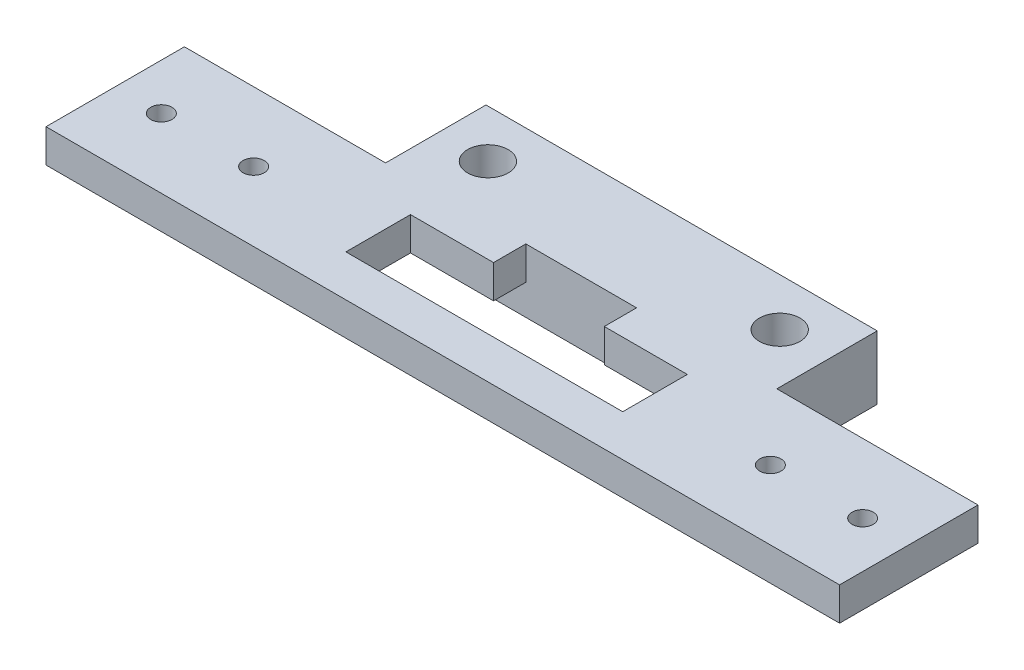
ISO-10303-21;
HEADER;
FILE_DESCRIPTION(('STEP AP214'),'2;1');
FILE_NAME('part.step','',(''),(''),'','','');
FILE_SCHEMA(('AUTOMOTIVE_DESIGN { 1 0 10303 214 1 1 1 1 }'));
ENDSEC;
DATA;
#1=APPLICATION_CONTEXT('core data for automotive mechanical design processes');
#2=APPLICATION_PROTOCOL_DEFINITION('international standard','automotive_design',2000,#1);
#3=PRODUCT_CONTEXT('',#1,'mechanical');
#4=PRODUCT('Part','Part','',(#3));
#5=PRODUCT_RELATED_PRODUCT_CATEGORY('part','',(#4));
#6=PRODUCT_DEFINITION_FORMATION('','',#4);
#7=PRODUCT_DEFINITION_CONTEXT('part definition',#1,'design');
#8=PRODUCT_DEFINITION('design','',#6,#7);
#9=PRODUCT_DEFINITION_SHAPE('','',#8);
#10=(LENGTH_UNIT() NAMED_UNIT(*) SI_UNIT(.MILLI.,.METRE.));
#11=(NAMED_UNIT(*) PLANE_ANGLE_UNIT() SI_UNIT($,.RADIAN.));
#12=(NAMED_UNIT(*) SI_UNIT($,.STERADIAN.) SOLID_ANGLE_UNIT());
#13=UNCERTAINTY_MEASURE_WITH_UNIT(LENGTH_MEASURE(1.E-05),#10,'distance_accuracy_value','');
#14=(GEOMETRIC_REPRESENTATION_CONTEXT(3) GLOBAL_UNCERTAINTY_ASSIGNED_CONTEXT((#13)) GLOBAL_UNIT_ASSIGNED_CONTEXT((#10,
#11,#12)) REPRESENTATION_CONTEXT('',''));
#15=CARTESIAN_POINT('',(0.,0.,0.));
#16=DIRECTION('',(0.,0.,1.));
#17=DIRECTION('',(1.,0.,0.));
#18=AXIS2_PLACEMENT_3D('',#15,#16,#17);
#19=CARTESIAN_POINT('',(0.,0.,0.));
#20=DIRECTION('',(0.,1.,0.));
#21=DIRECTION('',(0.,0.,1.));
#22=AXIS2_PLACEMENT_3D('',#19,#20,#21);
#23=PLANE('',#22);
#24=CARTESIAN_POINT('',(38.,0.,0.));
#25=DIRECTION('',(0.,1.,0.));
#26=DIRECTION('',(0.,0.,1.));
#27=AXIS2_PLACEMENT_3D('',#24,#25,#26);
#28=CIRCLE('',#27,1.15);
#29=CARTESIAN_POINT('',(38.,0.,1.15));
#30=VERTEX_POINT('',#29);
#31=EDGE_CURVE('E415',#30,#30,#28,.T.);
#32=ORIENTED_EDGE('',*,*,#31,.T.);
#33=EDGE_LOOP('',(#32));
#34=FACE_BOUND('',#33,.T.);
#35=CARTESIAN_POINT('',(28.,0.,0.));
#36=DIRECTION('',(0.,1.,0.));
#37=DIRECTION('',(0.,0.,1.));
#38=AXIS2_PLACEMENT_3D('',#35,#36,#37);
#39=CIRCLE('',#38,1.15);
#40=CARTESIAN_POINT('',(28.,0.,1.15));
#41=VERTEX_POINT('',#40);
#42=EDGE_CURVE('E418',#41,#41,#39,.T.);
#43=ORIENTED_EDGE('',*,*,#42,.T.);
#44=EDGE_LOOP('',(#43));
#45=FACE_BOUND('',#44,.T.);
#46=CARTESIAN_POINT('',(-28.,0.,0.));
#47=DIRECTION('',(0.,1.,0.));
#48=DIRECTION('',(0.,0.,1.));
#49=AXIS2_PLACEMENT_3D('',#46,#47,#48);
#50=CIRCLE('',#49,1.15);
#51=CARTESIAN_POINT('',(-28.,0.,1.15));
#52=VERTEX_POINT('',#51);
#53=EDGE_CURVE('E421',#52,#52,#50,.T.);
#54=ORIENTED_EDGE('',*,*,#53,.T.);
#55=EDGE_LOOP('',(#54));
#56=FACE_BOUND('',#55,.T.);
#57=CARTESIAN_POINT('',(-38.,0.,0.));
#58=DIRECTION('',(0.,1.,0.));
#59=DIRECTION('',(0.,0.,1.));
#60=AXIS2_PLACEMENT_3D('',#57,#58,#59);
#61=CIRCLE('',#60,1.15);
#62=CARTESIAN_POINT('',(-38.,0.,1.15));
#63=VERTEX_POINT('',#62);
#64=EDGE_CURVE('E424',#63,#63,#61,.T.);
#65=ORIENTED_EDGE('',*,*,#64,.T.);
#66=EDGE_LOOP('',(#65));
#67=FACE_BOUND('',#66,.T.);
#68=DIRECTION('',(-1.,0.,0.));
#69=VECTOR('',#68,1.);
#70=CARTESIAN_POINT('',(21.2,0.,-7.5));
#71=LINE('',#70,#69);
#72=CARTESIAN_POINT('',(21.2,0.,-7.5));
#73=VERTEX_POINT('',#72);
#74=CARTESIAN_POINT('',(6.,0.,-7.5));
#75=VERTEX_POINT('',#74);
#76=EDGE_CURVE('E46',#73,#75,#71,.T.);
#77=ORIENTED_EDGE('',*,*,#76,.F.);
#78=DIRECTION('',(1.,0.,0.));
#79=VECTOR('',#78,1.);
#80=CARTESIAN_POINT('',(0.,0.,-7.5));
#81=LINE('',#80,#79);
#82=CARTESIAN_POINT('',(43.,0.,-7.5));
#83=VERTEX_POINT('',#82);
#84=EDGE_CURVE('E345',#73,#83,#81,.T.);
#85=ORIENTED_EDGE('',*,*,#84,.T.);
#86=DIRECTION('',(0.,0.,-1.));
#87=VECTOR('',#86,1.);
#88=CARTESIAN_POINT('',(43.,0.,0.));
#89=LINE('',#88,#87);
#90=CARTESIAN_POINT('',(43.,0.,7.5));
#91=VERTEX_POINT('',#90);
#92=EDGE_CURVE('E412',#91,#83,#89,.T.);
#93=ORIENTED_EDGE('',*,*,#92,.F.);
#94=DIRECTION('',(1.,0.,0.));
#95=VECTOR('',#94,1.);
#96=CARTESIAN_POINT('',(0.,0.,7.5));
#97=LINE('',#96,#95);
#98=CARTESIAN_POINT('',(-43.,0.,7.5));
#99=VERTEX_POINT('',#98);
#100=EDGE_CURVE('E410',#99,#91,#97,.T.);
#101=ORIENTED_EDGE('',*,*,#100,.F.);
#102=DIRECTION('',(0.,0.,1.));
#103=VECTOR('',#102,1.);
#104=CARTESIAN_POINT('',(-43.,0.,0.));
#105=LINE('',#104,#103);
#106=CARTESIAN_POINT('',(-43.,0.,-7.5));
#107=VERTEX_POINT('',#106);
#108=EDGE_CURVE('E408',#107,#99,#105,.T.);
#109=ORIENTED_EDGE('',*,*,#108,.F.);
#110=DIRECTION('',(-1.,0.,0.));
#111=VECTOR('',#110,1.);
#112=CARTESIAN_POINT('',(0.,0.,-7.5));
#113=LINE('',#112,#111);
#114=CARTESIAN_POINT('',(-21.2,0.,-7.5));
#115=VERTEX_POINT('',#114);
#116=EDGE_CURVE('E406',#115,#107,#113,.T.);
#117=ORIENTED_EDGE('',*,*,#116,.F.);
#118=CARTESIAN_POINT('',(-6.,0.,-7.5));
#119=VERTEX_POINT('',#118);
#120=EDGE_CURVE('E11',#119,#115,#71,.T.);
#121=ORIENTED_EDGE('',*,*,#120,.F.);
#122=DIRECTION('',(0.,0.,1.));
#123=VECTOR('',#122,1.);
#124=CARTESIAN_POINT('',(-6.,0.,0.));
#125=LINE('',#124,#123);
#126=CARTESIAN_POINT('',(-6.,0.,-4.));
#127=VERTEX_POINT('',#126);
#128=EDGE_CURVE('E443',#119,#127,#125,.T.);
#129=ORIENTED_EDGE('',*,*,#128,.T.);
#130=DIRECTION('',(-1.,0.,0.));
#131=VECTOR('',#130,1.);
#132=CARTESIAN_POINT('',(0.,0.,-4.));
#133=LINE('',#132,#131);
#134=CARTESIAN_POINT('',(-15.,0.,-4.));
#135=VERTEX_POINT('',#134);
#136=EDGE_CURVE('E434',#127,#135,#133,.T.);
#137=ORIENTED_EDGE('',*,*,#136,.T.);
#138=DIRECTION('',(0.,0.,1.));
#139=VECTOR('',#138,1.);
#140=CARTESIAN_POINT('',(-15.,0.,0.));
#141=LINE('',#140,#139);
#142=CARTESIAN_POINT('',(-15.,0.,3.));
#143=VERTEX_POINT('',#142);
#144=EDGE_CURVE('E440',#135,#143,#141,.T.);
#145=ORIENTED_EDGE('',*,*,#144,.T.);
#146=DIRECTION('',(1.,0.,0.));
#147=VECTOR('',#146,1.);
#148=CARTESIAN_POINT('',(0.,0.,3.));
#149=LINE('',#148,#147);
#150=CARTESIAN_POINT('',(15.,0.,3.));
#151=VERTEX_POINT('',#150);
#152=EDGE_CURVE('E437',#143,#151,#149,.T.);
#153=ORIENTED_EDGE('',*,*,#152,.T.);
#154=DIRECTION('',(0.,0.,-1.));
#155=VECTOR('',#154,1.);
#156=CARTESIAN_POINT('',(15.,0.,0.));
#157=LINE('',#156,#155);
#158=CARTESIAN_POINT('',(15.,0.,-4.));
#159=VERTEX_POINT('',#158);
#160=EDGE_CURVE('E433',#151,#159,#157,.T.);
#161=ORIENTED_EDGE('',*,*,#160,.T.);
#162=CARTESIAN_POINT('',(6.,0.,-4.));
#163=VERTEX_POINT('',#162);
#164=EDGE_CURVE('E430',#159,#163,#133,.T.);
#165=ORIENTED_EDGE('',*,*,#164,.T.);
#166=DIRECTION('',(0.,0.,-1.));
#167=VECTOR('',#166,1.);
#168=CARTESIAN_POINT('',(6.,0.,0.));
#169=LINE('',#168,#167);
#170=EDGE_CURVE('E427',#163,#75,#169,.T.);
#171=ORIENTED_EDGE('',*,*,#170,.T.);
#172=EDGE_LOOP('',(#77,#85,#93,#101,#109,#117,#121,#129,#137,#145,#153,#161,#165,#171));
#173=FACE_BOUND('',#172,.T.);
#174=ADVANCED_FACE('F35',(#34,#45,#56,#67,#173),#23,.F.);
#175=DIRECTION('',(1.,0.,0.));
#176=VECTOR('',#175,1.);
#177=CARTESIAN_POINT('',(-17.8307259421637,0.,-16.7));
#178=LINE('',#177,#176);
#179=CARTESIAN_POINT('',(-17.8307259421637,0.,-16.7));
#180=VERTEX_POINT('',#179);
#181=CARTESIAN_POINT('',(-13.7892740578363,0.,-16.7));
#182=VERTEX_POINT('',#181);
#183=EDGE_CURVE('E289',#180,#182,#178,.T.);
#184=ORIENTED_EDGE('',*,*,#183,.T.);
#185=DIRECTION('',(0.5,0.,0.866025403784439));
#186=VECTOR('',#185,1.);
#187=CARTESIAN_POINT('',(-13.7892740578363,0.,-16.7));
#188=LINE('',#187,#186);
#189=CARTESIAN_POINT('',(-11.7685481156726,0.,-13.2));
#190=VERTEX_POINT('',#189);
#191=EDGE_CURVE('E247',#182,#190,#188,.T.);
#192=ORIENTED_EDGE('',*,*,#191,.T.);
#193=DIRECTION('',(-0.5,0.,0.866025403784438));
#194=VECTOR('',#193,1.);
#195=CARTESIAN_POINT('',(-11.7685481156726,0.,-13.2));
#196=LINE('',#195,#194);
#197=CARTESIAN_POINT('',(-13.7892740578363,0.,-9.7));
#198=VERTEX_POINT('',#197);
#199=EDGE_CURVE('E302',#190,#198,#196,.T.);
#200=ORIENTED_EDGE('',*,*,#199,.T.);
#201=DIRECTION('',(-1.,0.,0.));
#202=VECTOR('',#201,1.);
#203=CARTESIAN_POINT('',(-13.7892740578363,0.,-9.7));
#204=LINE('',#203,#202);
#205=CARTESIAN_POINT('',(-17.8307259421637,0.,-9.7));
#206=VERTEX_POINT('',#205);
#207=EDGE_CURVE('E305',#198,#206,#204,.T.);
#208=ORIENTED_EDGE('',*,*,#207,.T.);
#209=DIRECTION('',(-0.5,0.,-0.866025403784438));
#210=VECTOR('',#209,1.);
#211=CARTESIAN_POINT('',(-17.8307259421637,0.,-9.7));
#212=LINE('',#211,#210);
#213=CARTESIAN_POINT('',(-19.8514518843274,0.,-13.2));
#214=VERTEX_POINT('',#213);
#215=EDGE_CURVE('E308',#206,#214,#212,.T.);
#216=ORIENTED_EDGE('',*,*,#215,.T.);
#217=DIRECTION('',(0.5,0.,-0.866025403784438));
#218=VECTOR('',#217,1.);
#219=CARTESIAN_POINT('',(-19.8514518843274,0.,-13.2));
#220=LINE('',#219,#218);
#221=EDGE_CURVE('E311',#214,#180,#220,.T.);
#222=ORIENTED_EDGE('',*,*,#221,.T.);
#223=EDGE_LOOP('',(#184,#192,#200,#208,#216,#222));
#224=FACE_BOUND('',#223,.T.);
#225=CARTESIAN_POINT('',(-15.81,0.,-13.2));
#226=DIRECTION('',(0.,1.,0.));
#227=DIRECTION('',(0.,0.,1.));
#228=AXIS2_PLACEMENT_3D('',#225,#226,#227);
#229=CIRCLE('',#228,2.2);
#230=CARTESIAN_POINT('',(-15.81,0.,-11.));
#231=VERTEX_POINT('',#230);
#232=EDGE_CURVE('E446',#231,#231,#229,.T.);
#233=ORIENTED_EDGE('',*,*,#232,.T.);
#234=EDGE_LOOP('',(#233));
#235=FACE_BOUND('',#234,.T.);
#236=ADVANCED_FACE('F579',(#224,#235),#23,.F.);
#237=CARTESIAN_POINT('',(0.,3.6,-7.5));
#238=DIRECTION('',(0.,0.,-1.));
#239=DIRECTION('',(-1.,0.,0.));
#240=AXIS2_PLACEMENT_3D('',#237,#238,#239);
#241=PLANE('',#240);
#242=DIRECTION('',(0.,-1.,0.));
#243=VECTOR('',#242,1.);
#244=CARTESIAN_POINT('',(-6.,3.6,-7.5));
#245=LINE('',#244,#243);
#246=CARTESIAN_POINT('',(-6.,3.6,-7.5));
#247=VERTEX_POINT('',#246);
#248=EDGE_CURVE('E451',#247,#119,#245,.T.);
#249=ORIENTED_EDGE('',*,*,#248,.T.);
#250=ORIENTED_EDGE('',*,*,#120,.T.);
#251=DIRECTION('',(0.,1.,0.));
#252=VECTOR('',#251,1.);
#253=CARTESIAN_POINT('',(-21.2,-3.3,-7.5));
#254=LINE('',#253,#252);
#255=CARTESIAN_POINT('',(-21.2,-3.3,-7.5));
#256=VERTEX_POINT('',#255);
#257=EDGE_CURVE('E337',#256,#115,#254,.T.);
#258=ORIENTED_EDGE('',*,*,#257,.F.);
#259=DIRECTION('',(-1.,0.,0.));
#260=VECTOR('',#259,1.);
#261=CARTESIAN_POINT('',(21.2,-3.3,-7.5));
#262=LINE('',#261,#260);
#263=CARTESIAN_POINT('',(21.2,-3.3,-7.5));
#264=VERTEX_POINT('',#263);
#265=EDGE_CURVE('E333',#264,#256,#262,.T.);
#266=ORIENTED_EDGE('',*,*,#265,.F.);
#267=DIRECTION('',(0.,1.,0.));
#268=VECTOR('',#267,1.);
#269=CARTESIAN_POINT('',(21.2,-3.3,-7.5));
#270=LINE('',#269,#268);
#271=EDGE_CURVE('E342',#264,#73,#270,.T.);
#272=ORIENTED_EDGE('',*,*,#271,.T.);
#273=ORIENTED_EDGE('',*,*,#76,.T.);
#274=DIRECTION('',(0.,-1.,0.));
#275=VECTOR('',#274,1.);
#276=CARTESIAN_POINT('',(6.,3.6,-7.5));
#277=LINE('',#276,#275);
#278=CARTESIAN_POINT('',(6.,3.6,-7.5));
#279=VERTEX_POINT('',#278);
#280=EDGE_CURVE('E44',#279,#75,#277,.T.);
#281=ORIENTED_EDGE('',*,*,#280,.F.);
#282=DIRECTION('',(1.,0.,0.));
#283=VECTOR('',#282,1.);
#284=CARTESIAN_POINT('',(0.,3.6,-7.5));
#285=LINE('',#284,#283);
#286=EDGE_CURVE('E376',#247,#279,#285,.T.);
#287=ORIENTED_EDGE('',*,*,#286,.F.);
#288=EDGE_LOOP('',(#249,#250,#258,#266,#272,#273,#281,#287));
#289=FACE_BOUND('',#288,.T.);
#290=ADVANCED_FACE('F500',(#289),#241,.F.);
#291=CARTESIAN_POINT('',(6.,3.6,0.));
#292=DIRECTION('',(-1.,0.,0.));
#293=DIRECTION('',(0.,0.,1.));
#294=AXIS2_PLACEMENT_3D('',#291,#292,#293);
#295=PLANE('',#294);
#296=ORIENTED_EDGE('',*,*,#170,.F.);
#297=DIRECTION('',(0.,-1.,0.));
#298=VECTOR('',#297,1.);
#299=CARTESIAN_POINT('',(6.,3.6,-4.));
#300=LINE('',#299,#298);
#301=CARTESIAN_POINT('',(6.,3.6,-4.));
#302=VERTEX_POINT('',#301);
#303=EDGE_CURVE('E464',#302,#163,#300,.T.);
#304=ORIENTED_EDGE('',*,*,#303,.F.);
#305=DIRECTION('',(0.,0.,-1.));
#306=VECTOR('',#305,1.);
#307=CARTESIAN_POINT('',(6.,3.6,0.));
#308=LINE('',#307,#306);
#309=EDGE_CURVE('E378',#302,#279,#308,.T.);
#310=ORIENTED_EDGE('',*,*,#309,.T.);
#311=ORIENTED_EDGE('',*,*,#280,.T.);
#312=EDGE_LOOP('',(#296,#304,#310,#311));
#313=FACE_BOUND('',#312,.T.);
#314=ADVANCED_FACE('F560',(#313),#295,.T.);
#315=CARTESIAN_POINT('',(0.,3.6,-4.));
#316=DIRECTION('',(0.,0.,1.));
#317=DIRECTION('',(1.,0.,0.));
#318=AXIS2_PLACEMENT_3D('',#315,#316,#317);
#319=PLANE('',#318);
#320=ORIENTED_EDGE('',*,*,#164,.F.);
#321=DIRECTION('',(0.,-1.,0.));
#322=VECTOR('',#321,1.);
#323=CARTESIAN_POINT('',(15.,3.6,-4.));
#324=LINE('',#323,#322);
#325=CARTESIAN_POINT('',(15.,3.6,-4.));
#326=VERTEX_POINT('',#325);
#327=EDGE_CURVE('E462',#326,#159,#324,.T.);
#328=ORIENTED_EDGE('',*,*,#327,.F.);
#329=DIRECTION('',(-1.,0.,0.));
#330=VECTOR('',#329,1.);
#331=CARTESIAN_POINT('',(0.,3.6,-4.));
#332=LINE('',#331,#330);
#333=EDGE_CURVE('E381',#326,#302,#332,.T.);
#334=ORIENTED_EDGE('',*,*,#333,.T.);
#335=ORIENTED_EDGE('',*,*,#303,.T.);
#336=EDGE_LOOP('',(#320,#328,#334,#335));
#337=FACE_BOUND('',#336,.T.);
#338=ADVANCED_FACE('F556',(#337),#319,.T.);
#339=CARTESIAN_POINT('',(15.,3.6,0.));
#340=DIRECTION('',(-1.,0.,0.));
#341=DIRECTION('',(0.,0.,1.));
#342=AXIS2_PLACEMENT_3D('',#339,#340,#341);
#343=PLANE('',#342);
#344=ORIENTED_EDGE('',*,*,#160,.F.);
#345=DIRECTION('',(0.,-1.,0.));
#346=VECTOR('',#345,1.);
#347=CARTESIAN_POINT('',(15.,3.6,3.));
#348=LINE('',#347,#346);
#349=CARTESIAN_POINT('',(15.,3.6,3.));
#350=VERTEX_POINT('',#349);
#351=EDGE_CURVE('E460',#350,#151,#348,.T.);
#352=ORIENTED_EDGE('',*,*,#351,.F.);
#353=DIRECTION('',(0.,0.,-1.));
#354=VECTOR('',#353,1.);
#355=CARTESIAN_POINT('',(15.,3.6,0.));
#356=LINE('',#355,#354);
#357=EDGE_CURVE('E384',#350,#326,#356,.T.);
#358=ORIENTED_EDGE('',*,*,#357,.T.);
#359=ORIENTED_EDGE('',*,*,#327,.T.);
#360=EDGE_LOOP('',(#344,#352,#358,#359));
#361=FACE_BOUND('',#360,.T.);
#362=ADVANCED_FACE('F552',(#361),#343,.T.);
#363=CARTESIAN_POINT('',(0.,3.6,3.));
#364=DIRECTION('',(0.,0.,-1.));
#365=DIRECTION('',(-1.,0.,0.));
#366=AXIS2_PLACEMENT_3D('',#363,#364,#365);
#367=PLANE('',#366);
#368=ORIENTED_EDGE('',*,*,#152,.F.);
#369=DIRECTION('',(0.,-1.,0.));
#370=VECTOR('',#369,1.);
#371=CARTESIAN_POINT('',(-15.,3.6,3.));
#372=LINE('',#371,#370);
#373=CARTESIAN_POINT('',(-15.,3.6,3.));
#374=VERTEX_POINT('',#373);
#375=EDGE_CURVE('E458',#374,#143,#372,.T.);
#376=ORIENTED_EDGE('',*,*,#375,.F.);
#377=DIRECTION('',(1.,0.,0.));
#378=VECTOR('',#377,1.);
#379=CARTESIAN_POINT('',(0.,3.6,3.));
#380=LINE('',#379,#378);
#381=EDGE_CURVE('E388',#374,#350,#380,.T.);
#382=ORIENTED_EDGE('',*,*,#381,.T.);
#383=ORIENTED_EDGE('',*,*,#351,.T.);
#384=EDGE_LOOP('',(#368,#376,#382,#383));
#385=FACE_BOUND('',#384,.T.);
#386=ADVANCED_FACE('F548',(#385),#367,.T.);
#387=CARTESIAN_POINT('',(-15.,3.6,0.));
#388=DIRECTION('',(1.,0.,0.));
#389=DIRECTION('',(0.,0.,-1.));
#390=AXIS2_PLACEMENT_3D('',#387,#388,#389);
#391=PLANE('',#390);
#392=ORIENTED_EDGE('',*,*,#144,.F.);
#393=DIRECTION('',(0.,-1.,0.));
#394=VECTOR('',#393,1.);
#395=CARTESIAN_POINT('',(-15.,3.6,-4.));
#396=LINE('',#395,#394);
#397=CARTESIAN_POINT('',(-15.,3.6,-4.));
#398=VERTEX_POINT('',#397);
#399=EDGE_CURVE('E456',#398,#135,#396,.T.);
#400=ORIENTED_EDGE('',*,*,#399,.F.);
#401=DIRECTION('',(0.,0.,1.));
#402=VECTOR('',#401,1.);
#403=CARTESIAN_POINT('',(-15.,3.6,0.));
#404=LINE('',#403,#402);
#405=EDGE_CURVE('E391',#398,#374,#404,.T.);
#406=ORIENTED_EDGE('',*,*,#405,.T.);
#407=ORIENTED_EDGE('',*,*,#375,.T.);
#408=EDGE_LOOP('',(#392,#400,#406,#407));
#409=FACE_BOUND('',#408,.T.);
#410=ADVANCED_FACE('F544',(#409),#391,.T.);
#411=ORIENTED_EDGE('',*,*,#136,.F.);
#412=DIRECTION('',(0.,-1.,0.));
#413=VECTOR('',#412,1.);
#414=CARTESIAN_POINT('',(-6.,3.6,-4.));
#415=LINE('',#414,#413);
#416=CARTESIAN_POINT('',(-6.,3.6,-4.));
#417=VERTEX_POINT('',#416);
#418=EDGE_CURVE('E454',#417,#127,#415,.T.);
#419=ORIENTED_EDGE('',*,*,#418,.F.);
#420=EDGE_CURVE('E385',#417,#398,#332,.T.);
#421=ORIENTED_EDGE('',*,*,#420,.T.);
#422=ORIENTED_EDGE('',*,*,#399,.T.);
#423=EDGE_LOOP('',(#411,#419,#421,#422));
#424=FACE_BOUND('',#423,.T.);
#425=ADVANCED_FACE('F540',(#424),#319,.T.);
#426=CARTESIAN_POINT('',(0.,3.6,-7.5));
#427=DIRECTION('',(0.,0.,-1.));
#428=DIRECTION('',(-1.,0.,0.));
#429=AXIS2_PLACEMENT_3D('',#426,#427,#428);
#430=PLANE('',#429);
#431=ORIENTED_EDGE('',*,*,#84,.F.);
#432=DIRECTION('',(0.,-1.,0.));
#433=VECTOR('',#432,1.);
#434=CARTESIAN_POINT('',(21.2,3.6,-7.5));
#435=LINE('',#434,#433);
#436=CARTESIAN_POINT('',(21.2,3.6,-7.5));
#437=VERTEX_POINT('',#436);
#438=EDGE_CURVE('E39',#437,#73,#435,.T.);
#439=ORIENTED_EDGE('',*,*,#438,.F.);
#440=DIRECTION('',(1.,0.,0.));
#441=VECTOR('',#440,1.);
#442=CARTESIAN_POINT('',(0.,3.6,-7.5));
#443=LINE('',#442,#441);
#444=CARTESIAN_POINT('',(43.,3.6,-7.5));
#445=VERTEX_POINT('',#444);
#446=EDGE_CURVE('E346',#437,#445,#443,.T.);
#447=ORIENTED_EDGE('',*,*,#446,.T.);
#448=DIRECTION('',(0.,-1.,0.));
#449=VECTOR('',#448,1.);
#450=CARTESIAN_POINT('',(43.,3.6,-7.5));
#451=LINE('',#450,#449);
#452=EDGE_CURVE('E403',#445,#83,#451,.T.);
#453=ORIENTED_EDGE('',*,*,#452,.T.);
#454=EDGE_LOOP('',(#431,#439,#447,#453));
#455=FACE_BOUND('',#454,.T.);
#456=ADVANCED_FACE('F37',(#455),#430,.T.);
#457=CARTESIAN_POINT('',(21.2,3.6,0.));
#458=DIRECTION('',(-1.,0.,0.));
#459=DIRECTION('',(0.,0.,1.));
#460=AXIS2_PLACEMENT_3D('',#457,#458,#459);
#461=PLANE('',#460);
#462=ORIENTED_EDGE('',*,*,#438,.T.);
#463=ORIENTED_EDGE('',*,*,#271,.F.);
#464=DIRECTION('',(0.,0.,1.));
#465=VECTOR('',#464,1.);
#466=CARTESIAN_POINT('',(21.2,-3.3,-18.38));
#467=LINE('',#466,#465);
#468=CARTESIAN_POINT('',(21.2,-3.3,-18.38));
#469=VERTEX_POINT('',#468);
#470=EDGE_CURVE('E331',#469,#264,#467,.T.);
#471=ORIENTED_EDGE('',*,*,#470,.F.);
#472=DIRECTION('',(0.,-1.,0.));
#473=VECTOR('',#472,1.);
#474=CARTESIAN_POINT('',(21.2,3.6,-18.38));
#475=LINE('',#474,#473);
#476=CARTESIAN_POINT('',(21.2,3.6,-18.38));
#477=VERTEX_POINT('',#476);
#478=EDGE_CURVE('E481',#477,#469,#475,.T.);
#479=ORIENTED_EDGE('',*,*,#478,.F.);
#480=DIRECTION('',(0.,0.,-1.));
#481=VECTOR('',#480,1.);
#482=CARTESIAN_POINT('',(21.2,3.6,0.));
#483=LINE('',#482,#481);
#484=EDGE_CURVE('E349',#437,#477,#483,.T.);
#485=ORIENTED_EDGE('',*,*,#484,.F.);
#486=EDGE_LOOP('',(#462,#463,#471,#479,#485));
#487=FACE_BOUND('',#486,.T.);
#488=ADVANCED_FACE('F492',(#487),#461,.F.);
#489=CARTESIAN_POINT('',(0.,3.6,-18.38));
#490=DIRECTION('',(0.,0.,1.));
#491=DIRECTION('',(1.,0.,0.));
#492=AXIS2_PLACEMENT_3D('',#489,#490,#491);
#493=PLANE('',#492);
#494=ORIENTED_EDGE('',*,*,#478,.T.);
#495=DIRECTION('',(1.,0.,0.));
#496=VECTOR('',#495,1.);
#497=CARTESIAN_POINT('',(-21.2,-3.3,-18.38));
#498=LINE('',#497,#496);
#499=CARTESIAN_POINT('',(-21.2,-3.3,-18.38));
#500=VERTEX_POINT('',#499);
#501=EDGE_CURVE('E328',#500,#469,#498,.T.);
#502=ORIENTED_EDGE('',*,*,#501,.F.);
#503=DIRECTION('',(0.,-1.,0.));
#504=VECTOR('',#503,1.);
#505=CARTESIAN_POINT('',(-21.2,3.6,-18.38));
#506=LINE('',#505,#504);
#507=CARTESIAN_POINT('',(-21.2,3.6,-18.38));
#508=VERTEX_POINT('',#507);
#509=EDGE_CURVE('E480',#508,#500,#506,.T.);
#510=ORIENTED_EDGE('',*,*,#509,.F.);
#511=DIRECTION('',(-1.,0.,0.));
#512=VECTOR('',#511,1.);
#513=CARTESIAN_POINT('',(0.,3.6,-18.38));
#514=LINE('',#513,#512);
#515=EDGE_CURVE('E352',#477,#508,#514,.T.);
#516=ORIENTED_EDGE('',*,*,#515,.F.);
#517=EDGE_LOOP('',(#494,#502,#510,#516));
#518=FACE_BOUND('',#517,.T.);
#519=ADVANCED_FACE('F507',(#518),#493,.F.);
#520=CARTESIAN_POINT('',(-21.2,3.6,0.));
#521=DIRECTION('',(1.,0.,0.));
#522=DIRECTION('',(0.,0.,-1.));
#523=AXIS2_PLACEMENT_3D('',#520,#521,#522);
#524=PLANE('',#523);
#525=ORIENTED_EDGE('',*,*,#509,.T.);
#526=DIRECTION('',(0.,0.,-1.));
#527=VECTOR('',#526,1.);
#528=CARTESIAN_POINT('',(-21.2,-3.3,-7.5));
#529=LINE('',#528,#527);
#530=EDGE_CURVE('E335',#256,#500,#529,.T.);
#531=ORIENTED_EDGE('',*,*,#530,.F.);
#532=ORIENTED_EDGE('',*,*,#257,.T.);
#533=DIRECTION('',(0.,-1.,0.));
#534=VECTOR('',#533,1.);
#535=CARTESIAN_POINT('',(-21.2,3.6,-7.5));
#536=LINE('',#535,#534);
#537=CARTESIAN_POINT('',(-21.2,3.6,-7.5));
#538=VERTEX_POINT('',#537);
#539=EDGE_CURVE('E477',#538,#115,#536,.T.);
#540=ORIENTED_EDGE('',*,*,#539,.F.);
#541=DIRECTION('',(0.,0.,1.));
#542=VECTOR('',#541,1.);
#543=CARTESIAN_POINT('',(-21.2,3.6,0.));
#544=LINE('',#543,#542);
#545=EDGE_CURVE('E354',#508,#538,#544,.T.);
#546=ORIENTED_EDGE('',*,*,#545,.F.);
#547=EDGE_LOOP('',(#525,#531,#532,#540,#546));
#548=FACE_BOUND('',#547,.T.);
#549=ADVANCED_FACE('F639',(#548),#524,.F.);
#550=CARTESIAN_POINT('',(0.,3.6,-7.5));
#551=DIRECTION('',(0.,0.,1.));
#552=DIRECTION('',(1.,0.,0.));
#553=AXIS2_PLACEMENT_3D('',#550,#551,#552);
#554=PLANE('',#553);
#555=ORIENTED_EDGE('',*,*,#116,.T.);
#556=DIRECTION('',(0.,-1.,0.));
#557=VECTOR('',#556,1.);
#558=CARTESIAN_POINT('',(-43.,3.6,-7.5));
#559=LINE('',#558,#557);
#560=CARTESIAN_POINT('',(-43.,3.6,-7.5));
#561=VERTEX_POINT('',#560);
#562=EDGE_CURVE('E474',#561,#107,#559,.T.);
#563=ORIENTED_EDGE('',*,*,#562,.F.);
#564=DIRECTION('',(-1.,0.,0.));
#565=VECTOR('',#564,1.);
#566=CARTESIAN_POINT('',(0.,3.6,-7.5));
#567=LINE('',#566,#565);
#568=EDGE_CURVE('E356',#538,#561,#567,.T.);
#569=ORIENTED_EDGE('',*,*,#568,.F.);
#570=ORIENTED_EDGE('',*,*,#539,.T.);
#571=EDGE_LOOP('',(#555,#563,#569,#570));
#572=FACE_BOUND('',#571,.T.);
#573=ADVANCED_FACE('F529',(#572),#554,.F.);
#574=CARTESIAN_POINT('',(-43.,3.6,0.));
#575=DIRECTION('',(1.,0.,0.));
#576=DIRECTION('',(0.,0.,-1.));
#577=AXIS2_PLACEMENT_3D('',#574,#575,#576);
#578=PLANE('',#577);
#579=ORIENTED_EDGE('',*,*,#108,.T.);
#580=DIRECTION('',(0.,-1.,0.));
#581=VECTOR('',#580,1.);
#582=CARTESIAN_POINT('',(-43.,3.6,7.5));
#583=LINE('',#582,#581);
#584=CARTESIAN_POINT('',(-43.,3.6,7.5));
#585=VERTEX_POINT('',#584);
#586=EDGE_CURVE('E471',#585,#99,#583,.T.);
#587=ORIENTED_EDGE('',*,*,#586,.F.);
#588=DIRECTION('',(0.,0.,1.));
#589=VECTOR('',#588,1.);
#590=CARTESIAN_POINT('',(-43.,3.6,0.));
#591=LINE('',#590,#589);
#592=EDGE_CURVE('E358',#561,#585,#591,.T.);
#593=ORIENTED_EDGE('',*,*,#592,.F.);
#594=ORIENTED_EDGE('',*,*,#562,.T.);
#595=EDGE_LOOP('',(#579,#587,#593,#594));
#596=FACE_BOUND('',#595,.T.);
#597=ADVANCED_FACE('F525',(#596),#578,.F.);
#598=CARTESIAN_POINT('',(0.,3.6,7.5));
#599=DIRECTION('',(0.,0.,-1.));
#600=DIRECTION('',(-1.,0.,0.));
#601=AXIS2_PLACEMENT_3D('',#598,#599,#600);
#602=PLANE('',#601);
#603=ORIENTED_EDGE('',*,*,#100,.T.);
#604=DIRECTION('',(0.,-1.,0.));
#605=VECTOR('',#604,1.);
#606=CARTESIAN_POINT('',(43.,3.6,7.5));
#607=LINE('',#606,#605);
#608=CARTESIAN_POINT('',(43.,3.6,7.5));
#609=VERTEX_POINT('',#608);
#610=EDGE_CURVE('E468',#609,#91,#607,.T.);
#611=ORIENTED_EDGE('',*,*,#610,.F.);
#612=DIRECTION('',(1.,0.,0.));
#613=VECTOR('',#612,1.);
#614=CARTESIAN_POINT('',(0.,3.6,7.5));
#615=LINE('',#614,#613);
#616=EDGE_CURVE('E360',#585,#609,#615,.T.);
#617=ORIENTED_EDGE('',*,*,#616,.F.);
#618=ORIENTED_EDGE('',*,*,#586,.T.);
#619=EDGE_LOOP('',(#603,#611,#617,#618));
#620=FACE_BOUND('',#619,.T.);
#621=ADVANCED_FACE('F521',(#620),#602,.F.);
#622=CARTESIAN_POINT('',(-15.81,3.6,-13.2));
#623=DIRECTION('',(0.,-1.,0.));
#624=DIRECTION('',(0.,0.,-1.));
#625=AXIS2_PLACEMENT_3D('',#622,#623,#624);
#626=CYLINDRICAL_SURFACE('',#625,2.2);
#627=CARTESIAN_POINT('',(-15.81,3.6,-13.2));
#628=DIRECTION('',(0.,1.,0.));
#629=DIRECTION('',(0.,0.,1.));
#630=AXIS2_PLACEMENT_3D('',#627,#628,#629);
#631=CIRCLE('',#630,2.2);
#632=CARTESIAN_POINT('',(-15.81,3.6,-11.));
#633=VERTEX_POINT('',#632);
#634=EDGE_CURVE('E397',#633,#633,#631,.T.);
#635=ORIENTED_EDGE('',*,*,#634,.T.);
#636=EDGE_LOOP('',(#635));
#637=FACE_BOUND('',#636,.T.);
#638=ORIENTED_EDGE('',*,*,#232,.F.);
#639=EDGE_LOOP('',(#638));
#640=FACE_BOUND('',#639,.T.);
#641=ADVANCED_FACE('F596',(#637,#640),#626,.F.);
#642=CARTESIAN_POINT('',(-6.,3.6,0.));
#643=DIRECTION('',(1.,0.,0.));
#644=DIRECTION('',(0.,0.,-1.));
#645=AXIS2_PLACEMENT_3D('',#642,#643,#644);
#646=PLANE('',#645);
#647=ORIENTED_EDGE('',*,*,#128,.F.);
#648=ORIENTED_EDGE('',*,*,#248,.F.);
#649=DIRECTION('',(0.,0.,1.));
#650=VECTOR('',#649,1.);
#651=CARTESIAN_POINT('',(-6.,3.6,0.));
#652=LINE('',#651,#650);
#653=EDGE_CURVE('E394',#247,#417,#652,.T.);
#654=ORIENTED_EDGE('',*,*,#653,.T.);
#655=ORIENTED_EDGE('',*,*,#418,.T.);
#656=EDGE_LOOP('',(#647,#648,#654,#655));
#657=FACE_BOUND('',#656,.T.);
#658=ADVANCED_FACE('F535',(#657),#646,.T.);
#659=CARTESIAN_POINT('',(-38.,3.6,0.));
#660=DIRECTION('',(0.,-1.,0.));
#661=DIRECTION('',(0.,0.,-1.));
#662=AXIS2_PLACEMENT_3D('',#659,#660,#661);
#663=CYLINDRICAL_SURFACE('',#662,1.15);
#664=CARTESIAN_POINT('',(-38.,3.6,0.));
#665=DIRECTION('',(0.,1.,0.));
#666=DIRECTION('',(0.,0.,1.));
#667=AXIS2_PLACEMENT_3D('',#664,#665,#666);
#668=CIRCLE('',#667,1.15);
#669=CARTESIAN_POINT('',(-38.,3.6,1.15));
#670=VERTEX_POINT('',#669);
#671=EDGE_CURVE('E373',#670,#670,#668,.T.);
#672=ORIENTED_EDGE('',*,*,#671,.T.);
#673=EDGE_LOOP('',(#672));
#674=FACE_BOUND('',#673,.T.);
#675=ORIENTED_EDGE('',*,*,#64,.F.);
#676=EDGE_LOOP('',(#675));
#677=FACE_BOUND('',#676,.T.);
#678=ADVANCED_FACE('F604',(#674,#677),#663,.F.);
#679=CARTESIAN_POINT('',(-28.,3.6,0.));
#680=DIRECTION('',(0.,-1.,0.));
#681=DIRECTION('',(0.,0.,-1.));
#682=AXIS2_PLACEMENT_3D('',#679,#680,#681);
#683=CYLINDRICAL_SURFACE('',#682,1.15);
#684=CARTESIAN_POINT('',(-28.,3.6,0.));
#685=DIRECTION('',(0.,1.,0.));
#686=DIRECTION('',(0.,0.,1.));
#687=AXIS2_PLACEMENT_3D('',#684,#685,#686);
#688=CIRCLE('',#687,1.15);
#689=CARTESIAN_POINT('',(-28.,3.6,1.15));
#690=VERTEX_POINT('',#689);
#691=EDGE_CURVE('E370',#690,#690,#688,.T.);
#692=ORIENTED_EDGE('',*,*,#691,.T.);
#693=EDGE_LOOP('',(#692));
#694=FACE_BOUND('',#693,.T.);
#695=ORIENTED_EDGE('',*,*,#53,.F.);
#696=EDGE_LOOP('',(#695));
#697=FACE_BOUND('',#696,.T.);
#698=ADVANCED_FACE('F620',(#694,#697),#683,.F.);
#699=CARTESIAN_POINT('',(28.,3.6,0.));
#700=DIRECTION('',(0.,-1.,0.));
#701=DIRECTION('',(0.,0.,-1.));
#702=AXIS2_PLACEMENT_3D('',#699,#700,#701);
#703=CYLINDRICAL_SURFACE('',#702,1.15);
#704=CARTESIAN_POINT('',(28.,3.6,0.));
#705=DIRECTION('',(0.,1.,0.));
#706=DIRECTION('',(0.,0.,1.));
#707=AXIS2_PLACEMENT_3D('',#704,#705,#706);
#708=CIRCLE('',#707,1.15);
#709=CARTESIAN_POINT('',(28.,3.6,1.15));
#710=VERTEX_POINT('',#709);
#711=EDGE_CURVE('E367',#710,#710,#708,.T.);
#712=ORIENTED_EDGE('',*,*,#711,.T.);
#713=EDGE_LOOP('',(#712));
#714=FACE_BOUND('',#713,.T.);
#715=ORIENTED_EDGE('',*,*,#42,.F.);
#716=EDGE_LOOP('',(#715));
#717=FACE_BOUND('',#716,.T.);
#718=ADVANCED_FACE('F624',(#714,#717),#703,.F.);
#719=CARTESIAN_POINT('',(38.,3.6,0.));
#720=DIRECTION('',(0.,-1.,0.));
#721=DIRECTION('',(0.,0.,-1.));
#722=AXIS2_PLACEMENT_3D('',#719,#720,#721);
#723=CYLINDRICAL_SURFACE('',#722,1.15);
#724=CARTESIAN_POINT('',(38.,3.6,0.));
#725=DIRECTION('',(0.,1.,0.));
#726=DIRECTION('',(0.,0.,1.));
#727=AXIS2_PLACEMENT_3D('',#724,#725,#726);
#728=CIRCLE('',#727,1.15);
#729=CARTESIAN_POINT('',(38.,3.6,1.15));
#730=VERTEX_POINT('',#729);
#731=EDGE_CURVE('E364',#730,#730,#728,.T.);
#732=ORIENTED_EDGE('',*,*,#731,.T.);
#733=EDGE_LOOP('',(#732));
#734=FACE_BOUND('',#733,.T.);
#735=ORIENTED_EDGE('',*,*,#31,.F.);
#736=EDGE_LOOP('',(#735));
#737=FACE_BOUND('',#736,.T.);
#738=ADVANCED_FACE('F628',(#734,#737),#723,.F.);
#739=CARTESIAN_POINT('',(43.,3.6,0.));
#740=DIRECTION('',(-1.,0.,0.));
#741=DIRECTION('',(0.,0.,1.));
#742=AXIS2_PLACEMENT_3D('',#739,#740,#741);
#743=PLANE('',#742);
#744=ORIENTED_EDGE('',*,*,#92,.T.);
#745=ORIENTED_EDGE('',*,*,#452,.F.);
#746=DIRECTION('',(0.,0.,-1.));
#747=VECTOR('',#746,1.);
#748=CARTESIAN_POINT('',(43.,3.6,0.));
#749=LINE('',#748,#747);
#750=EDGE_CURVE('E362',#609,#445,#749,.T.);
#751=ORIENTED_EDGE('',*,*,#750,.F.);
#752=ORIENTED_EDGE('',*,*,#610,.T.);
#753=EDGE_LOOP('',(#744,#745,#751,#752));
#754=FACE_BOUND('',#753,.T.);
#755=ADVANCED_FACE('F517',(#754),#743,.F.);
#756=CARTESIAN_POINT('',(15.81,3.6,-13.2));
#757=DIRECTION('',(0.,-1.,0.));
#758=DIRECTION('',(0.,0.,-1.));
#759=AXIS2_PLACEMENT_3D('',#756,#757,#758);
#760=CYLINDRICAL_SURFACE('',#759,2.2);
#761=CARTESIAN_POINT('',(15.81,3.6,-13.2));
#762=DIRECTION('',(0.,1.,0.));
#763=DIRECTION('',(0.,0.,1.));
#764=AXIS2_PLACEMENT_3D('',#761,#762,#763);
#765=CIRCLE('',#764,2.2);
#766=CARTESIAN_POINT('',(15.81,3.6,-11.));
#767=VERTEX_POINT('',#766);
#768=EDGE_CURVE('E400',#767,#767,#765,.T.);
#769=ORIENTED_EDGE('',*,*,#768,.T.);
#770=EDGE_LOOP('',(#769));
#771=FACE_BOUND('',#770,.T.);
#772=CARTESIAN_POINT('',(15.81,0.,-13.2));
#773=DIRECTION('',(0.,1.,0.));
#774=DIRECTION('',(0.,0.,1.));
#775=AXIS2_PLACEMENT_3D('',#772,#773,#774);
#776=CIRCLE('',#775,2.2);
#777=CARTESIAN_POINT('',(15.81,0.,-11.));
#778=VERTEX_POINT('',#777);
#779=EDGE_CURVE('E350',#778,#778,#776,.T.);
#780=ORIENTED_EDGE('',*,*,#779,.F.);
#781=EDGE_LOOP('',(#780));
#782=FACE_BOUND('',#781,.T.);
#783=ADVANCED_FACE('F565',(#771,#782),#760,.F.);
#784=CARTESIAN_POINT('',(0.,3.6,0.));
#785=DIRECTION('',(0.,1.,0.));
#786=DIRECTION('',(0.,0.,1.));
#787=AXIS2_PLACEMENT_3D('',#784,#785,#786);
#788=PLANE('',#787);
#789=ORIENTED_EDGE('',*,*,#446,.F.);
#790=ORIENTED_EDGE('',*,*,#484,.T.);
#791=ORIENTED_EDGE('',*,*,#515,.T.);
#792=ORIENTED_EDGE('',*,*,#545,.T.);
#793=ORIENTED_EDGE('',*,*,#568,.T.);
#794=ORIENTED_EDGE('',*,*,#592,.T.);
#795=ORIENTED_EDGE('',*,*,#616,.T.);
#796=ORIENTED_EDGE('',*,*,#750,.T.);
#797=EDGE_LOOP('',(#789,#790,#791,#792,#793,#794,#795,#796));
#798=FACE_BOUND('',#797,.T.);
#799=ORIENTED_EDGE('',*,*,#731,.F.);
#800=EDGE_LOOP('',(#799));
#801=FACE_BOUND('',#800,.T.);
#802=ORIENTED_EDGE('',*,*,#711,.F.);
#803=EDGE_LOOP('',(#802));
#804=FACE_BOUND('',#803,.T.);
#805=ORIENTED_EDGE('',*,*,#691,.F.);
#806=EDGE_LOOP('',(#805));
#807=FACE_BOUND('',#806,.T.);
#808=ORIENTED_EDGE('',*,*,#671,.F.);
#809=EDGE_LOOP('',(#808));
#810=FACE_BOUND('',#809,.T.);
#811=ORIENTED_EDGE('',*,*,#286,.T.);
#812=ORIENTED_EDGE('',*,*,#309,.F.);
#813=ORIENTED_EDGE('',*,*,#333,.F.);
#814=ORIENTED_EDGE('',*,*,#357,.F.);
#815=ORIENTED_EDGE('',*,*,#381,.F.);
#816=ORIENTED_EDGE('',*,*,#405,.F.);
#817=ORIENTED_EDGE('',*,*,#420,.F.);
#818=ORIENTED_EDGE('',*,*,#653,.F.);
#819=EDGE_LOOP('',(#811,#812,#813,#814,#815,#816,#817,#818));
#820=FACE_BOUND('',#819,.T.);
#821=ORIENTED_EDGE('',*,*,#634,.F.);
#822=EDGE_LOOP('',(#821));
#823=FACE_BOUND('',#822,.T.);
#824=ORIENTED_EDGE('',*,*,#768,.F.);
#825=EDGE_LOOP('',(#824));
#826=FACE_BOUND('',#825,.T.);
#827=ADVANCED_FACE('F510',(#798,#801,#804,#807,#810,#820,#823,#826),#788,.T.);
#828=DIRECTION('',(1.,0.,0.));
#829=VECTOR('',#828,1.);
#830=CARTESIAN_POINT('',(13.7892740578363,0.,-16.7));
#831=LINE('',#830,#829);
#832=CARTESIAN_POINT('',(13.7892740578363,0.,-16.7));
#833=VERTEX_POINT('',#832);
#834=CARTESIAN_POINT('',(17.8307259421637,0.,-16.7));
#835=VERTEX_POINT('',#834);
#836=EDGE_CURVE('E240',#833,#835,#831,.T.);
#837=ORIENTED_EDGE('',*,*,#836,.T.);
#838=DIRECTION('',(0.5,0.,0.866025403784439));
#839=VECTOR('',#838,1.);
#840=CARTESIAN_POINT('',(17.8307259421637,0.,-16.7));
#841=LINE('',#840,#839);
#842=CARTESIAN_POINT('',(19.8514518843274,0.,-13.2));
#843=VERTEX_POINT('',#842);
#844=EDGE_CURVE('E264',#835,#843,#841,.T.);
#845=ORIENTED_EDGE('',*,*,#844,.T.);
#846=DIRECTION('',(-0.5,0.,0.866025403784438));
#847=VECTOR('',#846,1.);
#848=CARTESIAN_POINT('',(19.8514518843274,0.,-13.2));
#849=LINE('',#848,#847);
#850=CARTESIAN_POINT('',(17.8307259421637,0.,-9.7));
#851=VERTEX_POINT('',#850);
#852=EDGE_CURVE('E246',#843,#851,#849,.T.);
#853=ORIENTED_EDGE('',*,*,#852,.T.);
#854=DIRECTION('',(-1.,0.,0.));
#855=VECTOR('',#854,1.);
#856=CARTESIAN_POINT('',(17.8307259421637,0.,-9.7));
#857=LINE('',#856,#855);
#858=CARTESIAN_POINT('',(13.7892740578363,0.,-9.7));
#859=VERTEX_POINT('',#858);
#860=EDGE_CURVE('E267',#851,#859,#857,.T.);
#861=ORIENTED_EDGE('',*,*,#860,.T.);
#862=DIRECTION('',(-0.5,0.,-0.866025403784439));
#863=VECTOR('',#862,1.);
#864=CARTESIAN_POINT('',(13.7892740578363,0.,-9.7));
#865=LINE('',#864,#863);
#866=CARTESIAN_POINT('',(11.7685481156726,0.,-13.2));
#867=VERTEX_POINT('',#866);
#868=EDGE_CURVE('E270',#859,#867,#865,.T.);
#869=ORIENTED_EDGE('',*,*,#868,.T.);
#870=DIRECTION('',(0.5,0.,-0.866025403784439));
#871=VECTOR('',#870,1.);
#872=CARTESIAN_POINT('',(11.7685481156726,0.,-13.2));
#873=LINE('',#872,#871);
#874=EDGE_CURVE('E273',#867,#833,#873,.T.);
#875=ORIENTED_EDGE('',*,*,#874,.T.);
#876=EDGE_LOOP('',(#837,#845,#853,#861,#869,#875));
#877=FACE_BOUND('',#876,.T.);
#878=ORIENTED_EDGE('',*,*,#779,.T.);
#879=EDGE_LOOP('',(#878));
#880=FACE_BOUND('',#879,.T.);
#881=ADVANCED_FACE('F564',(#877,#880),#23,.F.);
#882=CARTESIAN_POINT('',(0.,-3.3,0.));
#883=DIRECTION('',(0.,-1.,0.));
#884=DIRECTION('',(0.,0.,-1.));
#885=AXIS2_PLACEMENT_3D('',#882,#883,#884);
#886=PLANE('',#885);
#887=ORIENTED_EDGE('',*,*,#501,.T.);
#888=ORIENTED_EDGE('',*,*,#470,.T.);
#889=ORIENTED_EDGE('',*,*,#265,.T.);
#890=ORIENTED_EDGE('',*,*,#530,.T.);
#891=EDGE_LOOP('',(#887,#888,#889,#890));
#892=FACE_BOUND('',#891,.T.);
#893=DIRECTION('',(-0.5,0.,0.866025403784438));
#894=VECTOR('',#893,1.);
#895=CARTESIAN_POINT('',(-11.7685481156726,-3.3,-13.2));
#896=LINE('',#895,#894);
#897=CARTESIAN_POINT('',(-11.7685481156726,-3.3,-13.2));
#898=VERTEX_POINT('',#897);
#899=CARTESIAN_POINT('',(-13.7892740578363,-3.3,-9.7));
#900=VERTEX_POINT('',#899);
#901=EDGE_CURVE('E288',#898,#900,#896,.T.);
#902=ORIENTED_EDGE('',*,*,#901,.F.);
#903=DIRECTION('',(0.5,0.,0.866025403784439));
#904=VECTOR('',#903,1.);
#905=CARTESIAN_POINT('',(-13.7892740578363,-3.3,-16.7));
#906=LINE('',#905,#904);
#907=CARTESIAN_POINT('',(-13.7892740578363,-3.3,-16.7));
#908=VERTEX_POINT('',#907);
#909=EDGE_CURVE('E286',#908,#898,#906,.T.);
#910=ORIENTED_EDGE('',*,*,#909,.F.);
#911=DIRECTION('',(1.,0.,0.));
#912=VECTOR('',#911,1.);
#913=CARTESIAN_POINT('',(-17.8307259421637,-3.3,-16.7));
#914=LINE('',#913,#912);
#915=CARTESIAN_POINT('',(-17.8307259421637,-3.3,-16.7));
#916=VERTEX_POINT('',#915);
#917=EDGE_CURVE('E298',#916,#908,#914,.T.);
#918=ORIENTED_EDGE('',*,*,#917,.F.);
#919=DIRECTION('',(0.5,0.,-0.866025403784438));
#920=VECTOR('',#919,1.);
#921=CARTESIAN_POINT('',(-19.8514518843274,-3.3,-13.2));
#922=LINE('',#921,#920);
#923=CARTESIAN_POINT('',(-19.8514518843274,-3.3,-13.2));
#924=VERTEX_POINT('',#923);
#925=EDGE_CURVE('E295',#924,#916,#922,.T.);
#926=ORIENTED_EDGE('',*,*,#925,.F.);
#927=DIRECTION('',(-0.5,0.,-0.866025403784438));
#928=VECTOR('',#927,1.);
#929=CARTESIAN_POINT('',(-17.8307259421637,-3.3,-9.7));
#930=LINE('',#929,#928);
#931=CARTESIAN_POINT('',(-17.8307259421637,-3.3,-9.7));
#932=VERTEX_POINT('',#931);
#933=EDGE_CURVE('E293',#932,#924,#930,.T.);
#934=ORIENTED_EDGE('',*,*,#933,.F.);
#935=DIRECTION('',(-1.,0.,0.));
#936=VECTOR('',#935,1.);
#937=CARTESIAN_POINT('',(-13.7892740578363,-3.3,-9.7));
#938=LINE('',#937,#936);
#939=EDGE_CURVE('E291',#900,#932,#938,.T.);
#940=ORIENTED_EDGE('',*,*,#939,.F.);
#941=EDGE_LOOP('',(#902,#910,#918,#926,#934,#940));
#942=FACE_BOUND('',#941,.T.);
#943=DIRECTION('',(-0.5,0.,0.866025403784438));
#944=VECTOR('',#943,1.);
#945=CARTESIAN_POINT('',(19.8514518843274,-3.3,-13.2));
#946=LINE('',#945,#944);
#947=CARTESIAN_POINT('',(19.8514518843274,-3.3,-13.2));
#948=VERTEX_POINT('',#947);
#949=CARTESIAN_POINT('',(17.8307259421637,-3.3,-9.7));
#950=VERTEX_POINT('',#949);
#951=EDGE_CURVE('E239',#948,#950,#946,.T.);
#952=ORIENTED_EDGE('',*,*,#951,.F.);
#953=DIRECTION('',(0.5,0.,0.866025403784439));
#954=VECTOR('',#953,1.);
#955=CARTESIAN_POINT('',(17.8307259421637,-3.3,-16.7));
#956=LINE('',#955,#954);
#957=CARTESIAN_POINT('',(17.8307259421637,-3.3,-16.7));
#958=VERTEX_POINT('',#957);
#959=EDGE_CURVE('E231',#958,#948,#956,.T.);
#960=ORIENTED_EDGE('',*,*,#959,.F.);
#961=DIRECTION('',(1.,0.,0.));
#962=VECTOR('',#961,1.);
#963=CARTESIAN_POINT('',(13.7892740578363,-3.3,-16.7));
#964=LINE('',#963,#962);
#965=CARTESIAN_POINT('',(13.7892740578363,-3.3,-16.7));
#966=VERTEX_POINT('',#965);
#967=EDGE_CURVE('E262',#966,#958,#964,.T.);
#968=ORIENTED_EDGE('',*,*,#967,.F.);
#969=DIRECTION('',(0.5,0.,-0.866025403784439));
#970=VECTOR('',#969,1.);
#971=CARTESIAN_POINT('',(11.7685481156726,-3.3,-13.2));
#972=LINE('',#971,#970);
#973=CARTESIAN_POINT('',(11.7685481156726,-3.3,-13.2));
#974=VERTEX_POINT('',#973);
#975=EDGE_CURVE('E259',#974,#966,#972,.T.);
#976=ORIENTED_EDGE('',*,*,#975,.F.);
#977=DIRECTION('',(-0.5,0.,-0.866025403784439));
#978=VECTOR('',#977,1.);
#979=CARTESIAN_POINT('',(13.7892740578363,-3.3,-9.7));
#980=LINE('',#979,#978);
#981=CARTESIAN_POINT('',(13.7892740578363,-3.3,-9.7));
#982=VERTEX_POINT('',#981);
#983=EDGE_CURVE('E255',#982,#974,#980,.T.);
#984=ORIENTED_EDGE('',*,*,#983,.F.);
#985=DIRECTION('',(-1.,0.,0.));
#986=VECTOR('',#985,1.);
#987=CARTESIAN_POINT('',(17.8307259421637,-3.3,-9.7));
#988=LINE('',#987,#986);
#989=EDGE_CURVE('E253',#950,#982,#988,.T.);
#990=ORIENTED_EDGE('',*,*,#989,.F.);
#991=EDGE_LOOP('',(#952,#960,#968,#976,#984,#990));
#992=FACE_BOUND('',#991,.T.);
#993=ADVANCED_FACE('F251',(#892,#942,#992),#886,.T.);
#994=CARTESIAN_POINT('',(-13.7892740578363,-3.3,-16.7));
#995=DIRECTION('',(-0.866025403784439,0.,0.5));
#996=DIRECTION('',(0.5,0.,0.866025403784439));
#997=AXIS2_PLACEMENT_3D('',#994,#995,#996);
#998=PLANE('',#997);
#999=ORIENTED_EDGE('',*,*,#191,.F.);
#1000=DIRECTION('',(0.,1.,0.));
#1001=VECTOR('',#1000,1.);
#1002=CARTESIAN_POINT('',(-13.7892740578363,-3.3,-16.7));
#1003=LINE('',#1002,#1001);
#1004=EDGE_CURVE('E53',#908,#182,#1003,.T.);
#1005=ORIENTED_EDGE('',*,*,#1004,.F.);
#1006=ORIENTED_EDGE('',*,*,#909,.T.);
#1007=DIRECTION('',(0.,1.,0.));
#1008=VECTOR('',#1007,1.);
#1009=CARTESIAN_POINT('',(-11.7685481156726,-3.3,-13.2));
#1010=LINE('',#1009,#1008);
#1011=EDGE_CURVE('E325',#898,#190,#1010,.T.);
#1012=ORIENTED_EDGE('',*,*,#1011,.T.);
#1013=EDGE_LOOP('',(#999,#1005,#1006,#1012));
#1014=FACE_BOUND('',#1013,.T.);
#1015=ADVANCED_FACE('F583',(#1014),#998,.T.);
#1016=CARTESIAN_POINT('',(-11.7685481156726,-3.3,-13.2));
#1017=DIRECTION('',(-0.866025403784438,0.,-0.5));
#1018=DIRECTION('',(-0.5,0.,0.866025403784439));
#1019=AXIS2_PLACEMENT_3D('',#1016,#1017,#1018);
#1020=PLANE('',#1019);
#1021=ORIENTED_EDGE('',*,*,#199,.F.);
#1022=ORIENTED_EDGE('',*,*,#1011,.F.);
#1023=ORIENTED_EDGE('',*,*,#901,.T.);
#1024=DIRECTION('',(0.,1.,0.));
#1025=VECTOR('',#1024,1.);
#1026=CARTESIAN_POINT('',(-13.7892740578363,-3.3,-9.7));
#1027=LINE('',#1026,#1025);
#1028=EDGE_CURVE('E323',#900,#198,#1027,.T.);
#1029=ORIENTED_EDGE('',*,*,#1028,.T.);
#1030=EDGE_LOOP('',(#1021,#1022,#1023,#1029));
#1031=FACE_BOUND('',#1030,.T.);
#1032=ADVANCED_FACE('F812',(#1031),#1020,.T.);
#1033=CARTESIAN_POINT('',(-13.7892740578363,-3.3,-9.7));
#1034=DIRECTION('',(0.,0.,-1.));
#1035=DIRECTION('',(-1.,0.,0.));
#1036=AXIS2_PLACEMENT_3D('',#1033,#1034,#1035);
#1037=PLANE('',#1036);
#1038=ORIENTED_EDGE('',*,*,#207,.F.);
#1039=ORIENTED_EDGE('',*,*,#1028,.F.);
#1040=ORIENTED_EDGE('',*,*,#939,.T.);
#1041=DIRECTION('',(0.,1.,0.));
#1042=VECTOR('',#1041,1.);
#1043=CARTESIAN_POINT('',(-17.8307259421637,-3.3,-9.7));
#1044=LINE('',#1043,#1042);
#1045=EDGE_CURVE('E321',#932,#206,#1044,.T.);
#1046=ORIENTED_EDGE('',*,*,#1045,.T.);
#1047=EDGE_LOOP('',(#1038,#1039,#1040,#1046));
#1048=FACE_BOUND('',#1047,.T.);
#1049=ADVANCED_FACE('F821',(#1048),#1037,.T.);
#1050=CARTESIAN_POINT('',(-17.8307259421637,-3.3,-9.7));
#1051=DIRECTION('',(0.866025403784438,0.,-0.5));
#1052=DIRECTION('',(-0.5,0.,-0.866025403784438));
#1053=AXIS2_PLACEMENT_3D('',#1050,#1051,#1052);
#1054=PLANE('',#1053);
#1055=ORIENTED_EDGE('',*,*,#215,.F.);
#1056=ORIENTED_EDGE('',*,*,#1045,.F.);
#1057=ORIENTED_EDGE('',*,*,#933,.T.);
#1058=DIRECTION('',(0.,1.,0.));
#1059=VECTOR('',#1058,1.);
#1060=CARTESIAN_POINT('',(-19.8514518843274,-3.3,-13.2));
#1061=LINE('',#1060,#1059);
#1062=EDGE_CURVE('E319',#924,#214,#1061,.T.);
#1063=ORIENTED_EDGE('',*,*,#1062,.T.);
#1064=EDGE_LOOP('',(#1055,#1056,#1057,#1063));
#1065=FACE_BOUND('',#1064,.T.);
#1066=ADVANCED_FACE('F830',(#1065),#1054,.T.);
#1067=CARTESIAN_POINT('',(-19.8514518843274,-3.3,-13.2));
#1068=DIRECTION('',(0.866025403784438,0.,0.5));
#1069=DIRECTION('',(0.5,0.,-0.866025403784438));
#1070=AXIS2_PLACEMENT_3D('',#1067,#1068,#1069);
#1071=PLANE('',#1070);
#1072=ORIENTED_EDGE('',*,*,#221,.F.);
#1073=ORIENTED_EDGE('',*,*,#1062,.F.);
#1074=ORIENTED_EDGE('',*,*,#925,.T.);
#1075=DIRECTION('',(0.,1.,0.));
#1076=VECTOR('',#1075,1.);
#1077=CARTESIAN_POINT('',(-17.8307259421637,-3.3,-16.7));
#1078=LINE('',#1077,#1076);
#1079=EDGE_CURVE('E317',#916,#180,#1078,.T.);
#1080=ORIENTED_EDGE('',*,*,#1079,.T.);
#1081=EDGE_LOOP('',(#1072,#1073,#1074,#1080));
#1082=FACE_BOUND('',#1081,.T.);
#1083=ADVANCED_FACE('F839',(#1082),#1071,.T.);
#1084=CARTESIAN_POINT('',(-17.8307259421637,-3.3,-16.7));
#1085=DIRECTION('',(0.,0.,1.));
#1086=DIRECTION('',(1.,0.,0.));
#1087=AXIS2_PLACEMENT_3D('',#1084,#1085,#1086);
#1088=PLANE('',#1087);
#1089=ORIENTED_EDGE('',*,*,#183,.F.);
#1090=ORIENTED_EDGE('',*,*,#1079,.F.);
#1091=ORIENTED_EDGE('',*,*,#917,.T.);
#1092=ORIENTED_EDGE('',*,*,#1004,.T.);
#1093=EDGE_LOOP('',(#1089,#1090,#1091,#1092));
#1094=FACE_BOUND('',#1093,.T.);
#1095=ADVANCED_FACE('F848',(#1094),#1088,.T.);
#1096=CARTESIAN_POINT('',(17.8307259421637,-3.3,-16.7));
#1097=DIRECTION('',(-0.866025403784439,0.,0.5));
#1098=DIRECTION('',(0.5,0.,0.866025403784439));
#1099=AXIS2_PLACEMENT_3D('',#1096,#1097,#1098);
#1100=PLANE('',#1099);
#1101=ORIENTED_EDGE('',*,*,#844,.F.);
#1102=DIRECTION('',(0.,1.,0.));
#1103=VECTOR('',#1102,1.);
#1104=CARTESIAN_POINT('',(17.8307259421637,-3.3,-16.7));
#1105=LINE('',#1104,#1103);
#1106=EDGE_CURVE('E61',#958,#835,#1105,.T.);
#1107=ORIENTED_EDGE('',*,*,#1106,.F.);
#1108=ORIENTED_EDGE('',*,*,#959,.T.);
#1109=DIRECTION('',(0.,1.,0.));
#1110=VECTOR('',#1109,1.);
#1111=CARTESIAN_POINT('',(19.8514518843274,-3.3,-13.2));
#1112=LINE('',#1111,#1110);
#1113=EDGE_CURVE('E234',#948,#843,#1112,.T.);
#1114=ORIENTED_EDGE('',*,*,#1113,.T.);
#1115=EDGE_LOOP('',(#1101,#1107,#1108,#1114));
#1116=FACE_BOUND('',#1115,.T.);
#1117=ADVANCED_FACE('F233',(#1116),#1100,.T.);
#1118=CARTESIAN_POINT('',(19.8514518843274,-3.3,-13.2));
#1119=DIRECTION('',(-0.866025403784438,0.,-0.5));
#1120=DIRECTION('',(-0.5,0.,0.866025403784439));
#1121=AXIS2_PLACEMENT_3D('',#1118,#1119,#1120);
#1122=PLANE('',#1121);
#1123=ORIENTED_EDGE('',*,*,#852,.F.);
#1124=ORIENTED_EDGE('',*,*,#1113,.F.);
#1125=ORIENTED_EDGE('',*,*,#951,.T.);
#1126=DIRECTION('',(0.,1.,0.));
#1127=VECTOR('',#1126,1.);
#1128=CARTESIAN_POINT('',(17.8307259421637,-3.3,-9.7));
#1129=LINE('',#1128,#1127);
#1130=EDGE_CURVE('E248',#950,#851,#1129,.T.);
#1131=ORIENTED_EDGE('',*,*,#1130,.T.);
#1132=EDGE_LOOP('',(#1123,#1124,#1125,#1131));
#1133=FACE_BOUND('',#1132,.T.);
#1134=ADVANCED_FACE('F243',(#1133),#1122,.T.);
#1135=CARTESIAN_POINT('',(17.8307259421637,-3.3,-9.7));
#1136=DIRECTION('',(0.,0.,-1.));
#1137=DIRECTION('',(-1.,0.,0.));
#1138=AXIS2_PLACEMENT_3D('',#1135,#1136,#1137);
#1139=PLANE('',#1138);
#1140=ORIENTED_EDGE('',*,*,#860,.F.);
#1141=ORIENTED_EDGE('',*,*,#1130,.F.);
#1142=ORIENTED_EDGE('',*,*,#989,.T.);
#1143=DIRECTION('',(0.,1.,0.));
#1144=VECTOR('',#1143,1.);
#1145=CARTESIAN_POINT('',(13.7892740578363,-3.3,-9.7));
#1146=LINE('',#1145,#1144);
#1147=EDGE_CURVE('E283',#982,#859,#1146,.T.);
#1148=ORIENTED_EDGE('',*,*,#1147,.T.);
#1149=EDGE_LOOP('',(#1140,#1141,#1142,#1148));
#1150=FACE_BOUND('',#1149,.T.);
#1151=ADVANCED_FACE('F871',(#1150),#1139,.T.);
#1152=CARTESIAN_POINT('',(13.7892740578363,-3.3,-9.7));
#1153=DIRECTION('',(0.866025403784439,0.,-0.5));
#1154=DIRECTION('',(-0.5,0.,-0.866025403784439));
#1155=AXIS2_PLACEMENT_3D('',#1152,#1153,#1154);
#1156=PLANE('',#1155);
#1157=ORIENTED_EDGE('',*,*,#868,.F.);
#1158=ORIENTED_EDGE('',*,*,#1147,.F.);
#1159=ORIENTED_EDGE('',*,*,#983,.T.);
#1160=DIRECTION('',(0.,1.,0.));
#1161=VECTOR('',#1160,1.);
#1162=CARTESIAN_POINT('',(11.7685481156726,-3.3,-13.2));
#1163=LINE('',#1162,#1161);
#1164=EDGE_CURVE('E281',#974,#867,#1163,.T.);
#1165=ORIENTED_EDGE('',*,*,#1164,.T.);
#1166=EDGE_LOOP('',(#1157,#1158,#1159,#1165));
#1167=FACE_BOUND('',#1166,.T.);
#1168=ADVANCED_FACE('F879',(#1167),#1156,.T.);
#1169=CARTESIAN_POINT('',(11.7685481156726,-3.3,-13.2));
#1170=DIRECTION('',(0.866025403784439,0.,0.5));
#1171=DIRECTION('',(0.5,0.,-0.866025403784439));
#1172=AXIS2_PLACEMENT_3D('',#1169,#1170,#1171);
#1173=PLANE('',#1172);
#1174=ORIENTED_EDGE('',*,*,#874,.F.);
#1175=ORIENTED_EDGE('',*,*,#1164,.F.);
#1176=ORIENTED_EDGE('',*,*,#975,.T.);
#1177=DIRECTION('',(0.,1.,0.));
#1178=VECTOR('',#1177,1.);
#1179=CARTESIAN_POINT('',(13.7892740578363,-3.3,-16.7));
#1180=LINE('',#1179,#1178);
#1181=EDGE_CURVE('E279',#966,#833,#1180,.T.);
#1182=ORIENTED_EDGE('',*,*,#1181,.T.);
#1183=EDGE_LOOP('',(#1174,#1175,#1176,#1182));
#1184=FACE_BOUND('',#1183,.T.);
#1185=ADVANCED_FACE('F888',(#1184),#1173,.T.);
#1186=CARTESIAN_POINT('',(13.7892740578363,-3.3,-16.7));
#1187=DIRECTION('',(0.,0.,1.));
#1188=DIRECTION('',(1.,0.,0.));
#1189=AXIS2_PLACEMENT_3D('',#1186,#1187,#1188);
#1190=PLANE('',#1189);
#1191=ORIENTED_EDGE('',*,*,#836,.F.);
#1192=ORIENTED_EDGE('',*,*,#1181,.F.);
#1193=ORIENTED_EDGE('',*,*,#967,.T.);
#1194=ORIENTED_EDGE('',*,*,#1106,.T.);
#1195=EDGE_LOOP('',(#1191,#1192,#1193,#1194));
#1196=FACE_BOUND('',#1195,.T.);
#1197=ADVANCED_FACE('F897',(#1196),#1190,.T.);
#1198=CLOSED_SHELL('',(#174,#236,#290,#314,#338,#362,#386,#410,#425,#456,#488,#519,#549,#573,
#597,#621,#641,#658,#678,#698,#718,#738,#755,#783,#827,#881,#993,#1015,#1032,#1049,#1066,#1083,
#1095,#1117,#1134,#1151,#1168,#1185,#1197));
#1199=MANIFOLD_SOLID_BREP('B2',#1198);
#1200=ADVANCED_BREP_SHAPE_REPRESENTATION('',(#18,#1199),#14);
#1201=SHAPE_DEFINITION_REPRESENTATION(#9,#1200);
ENDSEC;
END-ISO-10303-21;
